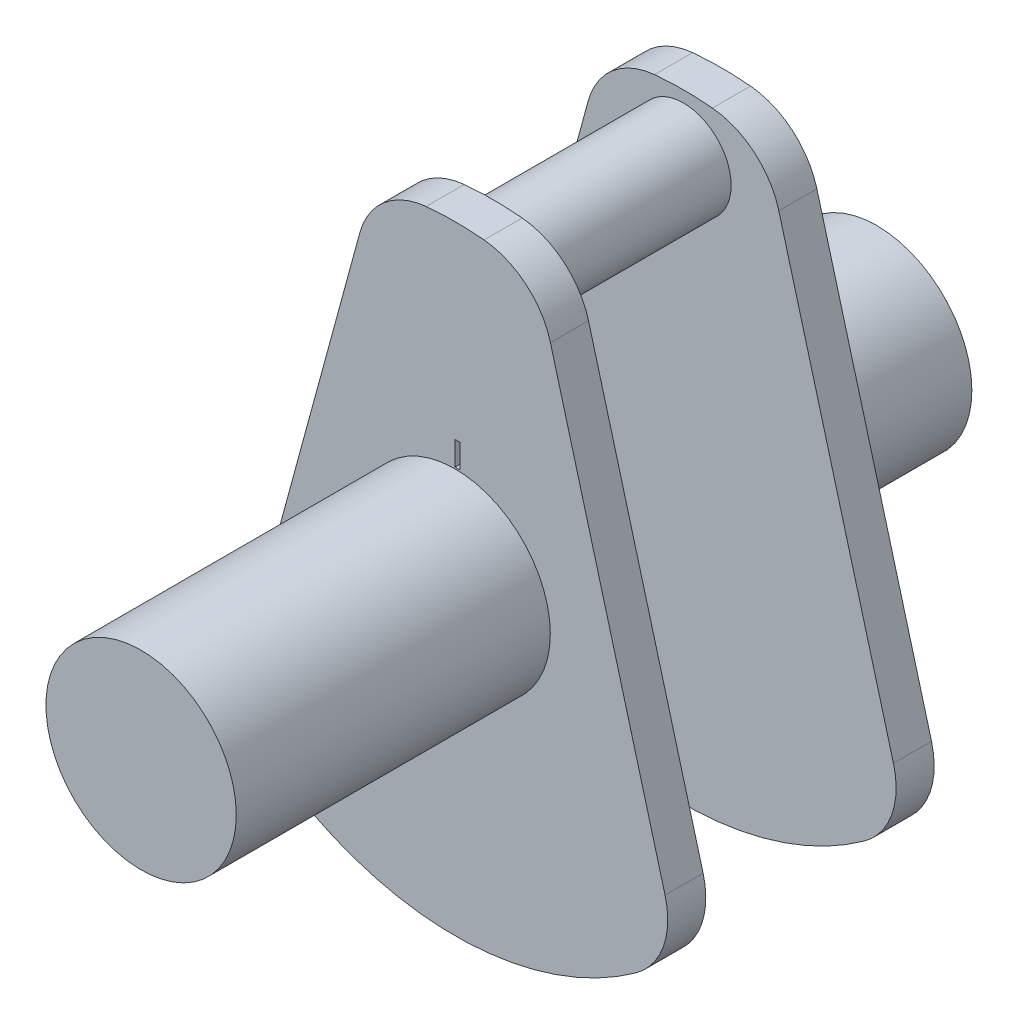
ISO-10303-21;
HEADER;
FILE_DESCRIPTION(('STEP AP214'),'2;1');
FILE_NAME('part.step','',(''),(''),'','','');
FILE_SCHEMA(('AUTOMOTIVE_DESIGN { 1 0 10303 214 1 1 1 1 }'));
ENDSEC;
DATA;
#1=APPLICATION_CONTEXT('core data for automotive mechanical design processes');
#2=APPLICATION_PROTOCOL_DEFINITION('international standard','automotive_design',2000,#1);
#3=PRODUCT_CONTEXT('',#1,'mechanical');
#4=PRODUCT('Part','Part','',(#3));
#5=PRODUCT_RELATED_PRODUCT_CATEGORY('part','',(#4));
#6=PRODUCT_DEFINITION_FORMATION('','',#4);
#7=PRODUCT_DEFINITION_CONTEXT('part definition',#1,'design');
#8=PRODUCT_DEFINITION('design','',#6,#7);
#9=PRODUCT_DEFINITION_SHAPE('','',#8);
#10=(LENGTH_UNIT() NAMED_UNIT(*) SI_UNIT(.MILLI.,.METRE.));
#11=(NAMED_UNIT(*) PLANE_ANGLE_UNIT() SI_UNIT($,.RADIAN.));
#12=(NAMED_UNIT(*) SI_UNIT($,.STERADIAN.) SOLID_ANGLE_UNIT());
#13=UNCERTAINTY_MEASURE_WITH_UNIT(LENGTH_MEASURE(1.E-05),#10,'distance_accuracy_value','');
#14=(GEOMETRIC_REPRESENTATION_CONTEXT(3) GLOBAL_UNCERTAINTY_ASSIGNED_CONTEXT((#13)) GLOBAL_UNIT_ASSIGNED_CONTEXT((#10,
#11,#12)) REPRESENTATION_CONTEXT('',''));
#15=CARTESIAN_POINT('',(0.,0.,0.));
#16=DIRECTION('',(0.,0.,1.));
#17=DIRECTION('',(1.,0.,0.));
#18=AXIS2_PLACEMENT_3D('',#15,#16,#17);
#19=CARTESIAN_POINT('',(0.459,4.87845457086565,0.8));
#20=DIRECTION('',(0.,0.,-1.));
#21=DIRECTION('',(-1.,0.,0.));
#22=AXIS2_PLACEMENT_3D('',#19,#20,#21);
#23=CYLINDRICAL_SURFACE('',#22,1.6);
#24=CARTESIAN_POINT('',(0.459,4.87845457086565,0.));
#25=DIRECTION('',(0.,0.,1.));
#26=DIRECTION('',(1.,0.,0.));
#27=AXIS2_PLACEMENT_3D('',#24,#25,#26);
#28=CIRCLE('',#27,1.6);
#29=CARTESIAN_POINT('',(2.00284320160388,5.29863092534255,0.));
#30=VERTEX_POINT('',#29);
#31=CARTESIAN_POINT('',(0.608877551020407,6.47141932869934,0.));
#32=VERTEX_POINT('',#31);
#33=EDGE_CURVE('E153',#30,#32,#28,.T.);
#34=ORIENTED_EDGE('',*,*,#33,.T.);
#35=DIRECTION('',(0.,0.,-1.));
#36=VECTOR('',#35,1.);
#37=CARTESIAN_POINT('',(0.608877551020407,6.47141932869934,0.8));
#38=LINE('',#37,#36);
#39=CARTESIAN_POINT('',(0.608877551020407,6.47141932869934,0.8));
#40=VERTEX_POINT('',#39);
#41=EDGE_CURVE('E47',#40,#32,#38,.T.);
#42=ORIENTED_EDGE('',*,*,#41,.F.);
#43=CARTESIAN_POINT('',(0.459,4.87845457086565,0.8));
#44=DIRECTION('',(0.,0.,1.));
#45=DIRECTION('',(1.,0.,0.));
#46=AXIS2_PLACEMENT_3D('',#43,#44,#45);
#47=CIRCLE('',#46,1.6);
#48=CARTESIAN_POINT('',(2.00284320160388,5.29863092534255,0.8));
#49=VERTEX_POINT('',#48);
#50=EDGE_CURVE('E177',#49,#40,#47,.T.);
#51=ORIENTED_EDGE('',*,*,#50,.F.);
#52=DIRECTION('',(0.,0.,-1.));
#53=VECTOR('',#52,1.);
#54=CARTESIAN_POINT('',(2.00284320160388,5.29863092534255,0.8));
#55=LINE('',#54,#53);
#56=EDGE_CURVE('E149',#49,#30,#55,.T.);
#57=ORIENTED_EDGE('',*,*,#56,.T.);
#58=EDGE_LOOP('',(#34,#42,#51,#57));
#59=FACE_BOUND('',#58,.T.);
#60=ADVANCED_FACE('F39',(#59),#23,.T.);
#61=CARTESIAN_POINT('',(0.,0.,0.8));
#62=DIRECTION('',(0.,0.,-1.));
#63=DIRECTION('',(-1.,0.,0.));
#64=AXIS2_PLACEMENT_3D('',#61,#62,#63);
#65=CYLINDRICAL_SURFACE('',#64,6.5);
#66=CARTESIAN_POINT('',(0.,0.,0.));
#67=DIRECTION('',(0.,0.,1.));
#68=DIRECTION('',(1.,0.,0.));
#69=AXIS2_PLACEMENT_3D('',#66,#67,#68);
#70=CIRCLE('',#69,6.5);
#71=CARTESIAN_POINT('',(-0.608877551020407,6.47141932869934,0.));
#72=VERTEX_POINT('',#71);
#73=EDGE_CURVE('E157',#32,#72,#70,.T.);
#74=ORIENTED_EDGE('',*,*,#73,.T.);
#75=DIRECTION('',(0.,0.,-1.));
#76=VECTOR('',#75,1.);
#77=CARTESIAN_POINT('',(-0.608877551020407,6.47141932869934,0.8));
#78=LINE('',#77,#76);
#79=CARTESIAN_POINT('',(-0.608877551020407,6.47141932869934,0.8));
#80=VERTEX_POINT('',#79);
#81=EDGE_CURVE('E192',#80,#72,#78,.T.);
#82=ORIENTED_EDGE('',*,*,#81,.F.);
#83=CARTESIAN_POINT('',(0.,0.,0.8));
#84=DIRECTION('',(0.,0.,1.));
#85=DIRECTION('',(1.,0.,0.));
#86=AXIS2_PLACEMENT_3D('',#83,#84,#85);
#87=CIRCLE('',#86,6.5);
#88=EDGE_CURVE('E105',#40,#80,#87,.T.);
#89=ORIENTED_EDGE('',*,*,#88,.F.);
#90=ORIENTED_EDGE('',*,*,#41,.T.);
#91=EDGE_LOOP('',(#74,#82,#89,#90));
#92=FACE_BOUND('',#91,.T.);
#93=ADVANCED_FACE('F197',(#92),#65,.T.);
#94=CARTESIAN_POINT('',(-0.459,4.87845457086565,0.8));
#95=DIRECTION('',(0.,0.,-1.));
#96=DIRECTION('',(-1.,0.,0.));
#97=AXIS2_PLACEMENT_3D('',#94,#95,#96);
#98=CYLINDRICAL_SURFACE('',#97,1.6);
#99=CARTESIAN_POINT('',(-0.459,4.87845457086565,0.));
#100=DIRECTION('',(0.,0.,1.));
#101=DIRECTION('',(-1.,0.,0.));
#102=AXIS2_PLACEMENT_3D('',#99,#100,#101);
#103=CIRCLE('',#102,1.6);
#104=CARTESIAN_POINT('',(-2.00284320160388,5.29863092534255,0.));
#105=VERTEX_POINT('',#104);
#106=EDGE_CURVE('E161',#72,#105,#103,.T.);
#107=ORIENTED_EDGE('',*,*,#106,.T.);
#108=DIRECTION('',(0.,0.,-1.));
#109=VECTOR('',#108,1.);
#110=CARTESIAN_POINT('',(-2.00284320160388,5.29863092534255,0.8));
#111=LINE('',#110,#109);
#112=CARTESIAN_POINT('',(-2.00284320160388,5.29863092534255,0.8));
#113=VERTEX_POINT('',#112);
#114=EDGE_CURVE('E188',#113,#105,#111,.T.);
#115=ORIENTED_EDGE('',*,*,#114,.F.);
#116=CARTESIAN_POINT('',(-0.459,4.87845457086565,0.8));
#117=DIRECTION('',(0.,0.,1.));
#118=DIRECTION('',(-1.,0.,0.));
#119=AXIS2_PLACEMENT_3D('',#116,#117,#118);
#120=CIRCLE('',#119,1.6);
#121=EDGE_CURVE('E216',#80,#113,#120,.T.);
#122=ORIENTED_EDGE('',*,*,#121,.F.);
#123=ORIENTED_EDGE('',*,*,#81,.T.);
#124=EDGE_LOOP('',(#107,#115,#122,#123));
#125=FACE_BOUND('',#124,.T.);
#126=ADVANCED_FACE('F208',(#125),#98,.T.);
#127=CARTESIAN_POINT('',(-2.00284320160388,5.29863092534255,0.8));
#128=DIRECTION('',(0.964902001002423,-0.26261022154806,0.));
#129=DIRECTION('',(0.26261022154806,0.964902001002423,0.));
#130=AXIS2_PLACEMENT_3D('',#127,#128,#129);
#131=PLANE('',#130);
#132=DIRECTION('',(-0.26261022154806,-0.964902001002423,0.));
#133=VECTOR('',#132,1.);
#134=CARTESIAN_POINT('',(-2.00284320160388,5.29863092534255,0.));
#135=LINE('',#134,#133);
#136=CARTESIAN_POINT('',(-4.41186786120333,-3.55278658921254,0.));
#137=VERTEX_POINT('',#136);
#138=EDGE_CURVE('E164',#105,#137,#135,.T.);
#139=ORIENTED_EDGE('',*,*,#138,.T.);
#140=DIRECTION('',(0.,0.,-1.));
#141=VECTOR('',#140,1.);
#142=CARTESIAN_POINT('',(-4.41186786120333,-3.55278658921254,0.8));
#143=LINE('',#142,#141);
#144=CARTESIAN_POINT('',(-4.41186786120333,-3.55278658921254,0.8));
#145=VERTEX_POINT('',#144);
#146=EDGE_CURVE('E184',#145,#137,#143,.T.);
#147=ORIENTED_EDGE('',*,*,#146,.F.);
#148=DIRECTION('',(-0.26261022154806,-0.964902001002423,0.));
#149=VECTOR('',#148,1.);
#150=CARTESIAN_POINT('',(-2.00284320160388,5.29863092534255,0.8));
#151=LINE('',#150,#149);
#152=EDGE_CURVE('E214',#113,#145,#151,.T.);
#153=ORIENTED_EDGE('',*,*,#152,.F.);
#154=ORIENTED_EDGE('',*,*,#114,.T.);
#155=EDGE_LOOP('',(#139,#147,#153,#154));
#156=FACE_BOUND('',#155,.T.);
#157=ADVANCED_FACE('F212',(#156),#131,.F.);
#158=CARTESIAN_POINT('',(-2.86802465959945,-3.97296294368944,0.8));
#159=DIRECTION('',(0.,0.,-1.));
#160=DIRECTION('',(-1.,0.,0.));
#161=AXIS2_PLACEMENT_3D('',#158,#159,#160);
#162=CYLINDRICAL_SURFACE('',#161,1.6);
#163=CARTESIAN_POINT('',(-2.86802465959945,-3.97296294368944,0.));
#164=DIRECTION('',(0.,0.,1.));
#165=DIRECTION('',(1.,0.,0.));
#166=AXIS2_PLACEMENT_3D('',#163,#164,#165);
#167=CIRCLE('',#166,1.6);
#168=CARTESIAN_POINT('',(-3.80452250763192,-5.27025696611864,0.));
#169=VERTEX_POINT('',#168);
#170=EDGE_CURVE('E167',#137,#169,#167,.T.);
#171=ORIENTED_EDGE('',*,*,#170,.T.);
#172=DIRECTION('',(0.,0.,-1.));
#173=VECTOR('',#172,1.);
#174=CARTESIAN_POINT('',(-3.80452250763192,-5.27025696611864,0.8));
#175=LINE('',#174,#173);
#176=CARTESIAN_POINT('',(-3.80452250763192,-5.27025696611864,0.8));
#177=VERTEX_POINT('',#176);
#178=EDGE_CURVE('E142',#177,#169,#175,.T.);
#179=ORIENTED_EDGE('',*,*,#178,.F.);
#180=CARTESIAN_POINT('',(-2.86802465959945,-3.97296294368944,0.8));
#181=DIRECTION('',(0.,0.,1.));
#182=DIRECTION('',(1.,0.,0.));
#183=AXIS2_PLACEMENT_3D('',#180,#181,#182);
#184=CIRCLE('',#183,1.6);
#185=EDGE_CURVE('E128',#145,#177,#184,.T.);
#186=ORIENTED_EDGE('',*,*,#185,.F.);
#187=ORIENTED_EDGE('',*,*,#146,.T.);
#188=EDGE_LOOP('',(#171,#179,#186,#187));
#189=FACE_BOUND('',#188,.T.);
#190=ADVANCED_FACE('F503',(#189),#162,.T.);
#191=CARTESIAN_POINT('',(0.,0.,0.8));
#192=DIRECTION('',(0.,0.,-1.));
#193=DIRECTION('',(-1.,0.,0.));
#194=AXIS2_PLACEMENT_3D('',#191,#192,#193);
#195=CYLINDRICAL_SURFACE('',#194,6.5);
#196=CARTESIAN_POINT('',(0.,0.,0.));
#197=DIRECTION('',(0.,0.,1.));
#198=DIRECTION('',(1.,0.,0.));
#199=AXIS2_PLACEMENT_3D('',#196,#197,#198);
#200=CIRCLE('',#199,6.5);
#201=CARTESIAN_POINT('',(3.80452250763193,-5.27025696611864,0.));
#202=VERTEX_POINT('',#201);
#203=EDGE_CURVE('E138',#169,#202,#200,.T.);
#204=ORIENTED_EDGE('',*,*,#203,.T.);
#205=DIRECTION('',(0.,0.,-1.));
#206=VECTOR('',#205,1.);
#207=CARTESIAN_POINT('',(3.80452250763193,-5.27025696611864,0.8));
#208=LINE('',#207,#206);
#209=CARTESIAN_POINT('',(3.80452250763193,-5.27025696611864,0.8));
#210=VERTEX_POINT('',#209);
#211=EDGE_CURVE('E135',#210,#202,#208,.T.);
#212=ORIENTED_EDGE('',*,*,#211,.F.);
#213=CARTESIAN_POINT('',(0.,0.,0.8));
#214=DIRECTION('',(0.,0.,1.));
#215=DIRECTION('',(1.,0.,0.));
#216=AXIS2_PLACEMENT_3D('',#213,#214,#215);
#217=CIRCLE('',#216,6.5);
#218=EDGE_CURVE('E121',#177,#210,#217,.T.);
#219=ORIENTED_EDGE('',*,*,#218,.F.);
#220=ORIENTED_EDGE('',*,*,#178,.T.);
#221=EDGE_LOOP('',(#204,#212,#219,#220));
#222=FACE_BOUND('',#221,.T.);
#223=ADVANCED_FACE('F136',(#222),#195,.T.);
#224=CARTESIAN_POINT('',(2.86802465959945,-3.97296294368944,0.8));
#225=DIRECTION('',(0.,0.,-1.));
#226=DIRECTION('',(-1.,0.,0.));
#227=AXIS2_PLACEMENT_3D('',#224,#225,#226);
#228=CYLINDRICAL_SURFACE('',#227,1.6);
#229=CARTESIAN_POINT('',(2.86802465959945,-3.97296294368944,0.));
#230=DIRECTION('',(0.,0.,1.));
#231=DIRECTION('',(-1.,0.,0.));
#232=AXIS2_PLACEMENT_3D('',#229,#230,#231);
#233=CIRCLE('',#232,1.6);
#234=CARTESIAN_POINT('',(4.41186786120333,-3.55278658921254,0.));
#235=VERTEX_POINT('',#234);
#236=EDGE_CURVE('E172',#202,#235,#233,.T.);
#237=ORIENTED_EDGE('',*,*,#236,.T.);
#238=DIRECTION('',(0.,0.,-1.));
#239=VECTOR('',#238,1.);
#240=CARTESIAN_POINT('',(4.41186786120333,-3.55278658921254,0.8));
#241=LINE('',#240,#239);
#242=CARTESIAN_POINT('',(4.41186786120333,-3.55278658921254,0.8));
#243=VERTEX_POINT('',#242);
#244=EDGE_CURVE('E143',#243,#235,#241,.T.);
#245=ORIENTED_EDGE('',*,*,#244,.F.);
#246=CARTESIAN_POINT('',(2.86802465959945,-3.97296294368944,0.8));
#247=DIRECTION('',(0.,0.,1.));
#248=DIRECTION('',(-1.,0.,0.));
#249=AXIS2_PLACEMENT_3D('',#246,#247,#248);
#250=CIRCLE('',#249,1.6);
#251=EDGE_CURVE('E125',#210,#243,#250,.T.);
#252=ORIENTED_EDGE('',*,*,#251,.F.);
#253=ORIENTED_EDGE('',*,*,#211,.T.);
#254=EDGE_LOOP('',(#237,#245,#252,#253));
#255=FACE_BOUND('',#254,.T.);
#256=ADVANCED_FACE('F145',(#255),#228,.T.);
#257=CARTESIAN_POINT('',(2.00284320160388,5.29863092534255,0.8));
#258=DIRECTION('',(-0.964902001002423,-0.26261022154806,0.));
#259=DIRECTION('',(0.26261022154806,-0.964902001002423,0.));
#260=AXIS2_PLACEMENT_3D('',#257,#258,#259);
#261=PLANE('',#260);
#262=DIRECTION('',(-0.26261022154806,0.964902001002423,0.));
#263=VECTOR('',#262,1.);
#264=CARTESIAN_POINT('',(2.00284320160388,5.29863092534255,0.));
#265=LINE('',#264,#263);
#266=EDGE_CURVE('E96',#235,#30,#265,.T.);
#267=ORIENTED_EDGE('',*,*,#266,.T.);
#268=ORIENTED_EDGE('',*,*,#56,.F.);
#269=DIRECTION('',(-0.26261022154806,0.964902001002423,0.));
#270=VECTOR('',#269,1.);
#271=CARTESIAN_POINT('',(2.00284320160388,5.29863092534255,0.8));
#272=LINE('',#271,#270);
#273=EDGE_CURVE('E63',#243,#49,#272,.T.);
#274=ORIENTED_EDGE('',*,*,#273,.F.);
#275=ORIENTED_EDGE('',*,*,#244,.T.);
#276=EDGE_LOOP('',(#267,#268,#274,#275));
#277=FACE_BOUND('',#276,.T.);
#278=ADVANCED_FACE('F511',(#277),#261,.F.);
#279=CARTESIAN_POINT('',(0.459,4.87845457086565,0.8));
#280=DIRECTION('',(0.,0.,1.));
#281=DIRECTION('',(1.,0.,0.));
#282=AXIS2_PLACEMENT_3D('',#279,#280,#281);
#283=PLANE('',#282);
#284=CARTESIAN_POINT('',(0.,5.259,0.8));
#285=DIRECTION('',(0.,0.,1.));
#286=DIRECTION('',(1.,0.,0.));
#287=AXIS2_PLACEMENT_3D('',#284,#285,#286);
#288=CIRCLE('',#287,1.);
#289=CARTESIAN_POINT('',(1.,5.259,0.8));
#290=VERTEX_POINT('',#289);
#291=EDGE_CURVE('E158',#290,#290,#288,.T.);
#292=ORIENTED_EDGE('',*,*,#291,.F.);
#293=EDGE_LOOP('',(#292));
#294=FACE_BOUND('',#293,.T.);
#295=ORIENTED_EDGE('',*,*,#50,.T.);
#296=ORIENTED_EDGE('',*,*,#88,.T.);
#297=ORIENTED_EDGE('',*,*,#121,.T.);
#298=ORIENTED_EDGE('',*,*,#152,.T.);
#299=ORIENTED_EDGE('',*,*,#185,.T.);
#300=ORIENTED_EDGE('',*,*,#218,.T.);
#301=ORIENTED_EDGE('',*,*,#251,.T.);
#302=ORIENTED_EDGE('',*,*,#273,.T.);
#303=EDGE_LOOP('',(#295,#296,#297,#298,#299,#300,#301,#302));
#304=FACE_BOUND('',#303,.T.);
#305=ADVANCED_FACE('F123',(#294,#304),#283,.T.);
#306=CARTESIAN_POINT('',(0.459,4.87845457086565,0.));
#307=DIRECTION('',(0.,0.,1.));
#308=DIRECTION('',(1.,0.,0.));
#309=AXIS2_PLACEMENT_3D('',#306,#307,#308);
#310=PLANE('',#309);
#311=CARTESIAN_POINT('',(0.,0.,0.));
#312=DIRECTION('',(0.,0.,1.));
#313=DIRECTION('',(1.,0.,0.));
#314=AXIS2_PLACEMENT_3D('',#311,#312,#313);
#315=CIRCLE('',#314,2.);
#316=CARTESIAN_POINT('',(2.,0.,0.));
#317=VERTEX_POINT('',#316);
#318=EDGE_CURVE('E11',#317,#317,#315,.F.);
#319=ORIENTED_EDGE('',*,*,#318,.F.);
#320=EDGE_LOOP('',(#319));
#321=FACE_BOUND('',#320,.T.);
#322=ORIENTED_EDGE('',*,*,#33,.F.);
#323=ORIENTED_EDGE('',*,*,#266,.F.);
#324=ORIENTED_EDGE('',*,*,#236,.F.);
#325=ORIENTED_EDGE('',*,*,#203,.F.);
#326=ORIENTED_EDGE('',*,*,#170,.F.);
#327=ORIENTED_EDGE('',*,*,#138,.F.);
#328=ORIENTED_EDGE('',*,*,#106,.F.);
#329=ORIENTED_EDGE('',*,*,#73,.F.);
#330=EDGE_LOOP('',(#322,#323,#324,#325,#326,#327,#328,#329));
#331=FACE_BOUND('',#330,.T.);
#332=ADVANCED_FACE('F202',(#321,#331),#310,.F.);
#333=CARTESIAN_POINT('',(0.,5.259,2.8));
#334=DIRECTION('',(0.,0.,-1.));
#335=DIRECTION('',(-1.,0.,0.));
#336=AXIS2_PLACEMENT_3D('',#333,#334,#335);
#337=CYLINDRICAL_SURFACE('',#336,1.);
#338=ORIENTED_EDGE('',*,*,#291,.T.);
#339=EDGE_LOOP('',(#338));
#340=FACE_BOUND('',#339,.T.);
#341=CARTESIAN_POINT('',(0.,5.259,4.8));
#342=DIRECTION('',(0.,0.,1.));
#343=DIRECTION('',(1.,0.,0.));
#344=AXIS2_PLACEMENT_3D('',#341,#342,#343);
#345=CIRCLE('',#344,1.);
#346=CARTESIAN_POINT('',(1.,5.259,4.8));
#347=VERTEX_POINT('',#346);
#348=EDGE_CURVE('E303',#347,#347,#345,.T.);
#349=ORIENTED_EDGE('',*,*,#348,.F.);
#350=EDGE_LOOP('',(#349));
#351=FACE_BOUND('',#350,.T.);
#352=ADVANCED_FACE('F516',(#340,#351),#337,.T.);
#353=CARTESIAN_POINT('',(0.,0.,-3.26));
#354=DIRECTION('',(0.,0.,1.));
#355=DIRECTION('',(1.,0.,0.));
#356=AXIS2_PLACEMENT_3D('',#353,#354,#355);
#357=CYLINDRICAL_SURFACE('',#356,2.);
#358=CARTESIAN_POINT('',(0.,0.,-3.26));
#359=DIRECTION('',(0.,0.,-1.));
#360=DIRECTION('',(-1.,0.,0.));
#361=AXIS2_PLACEMENT_3D('',#358,#359,#360);
#362=CIRCLE('',#361,2.);
#363=CARTESIAN_POINT('',(-2.,0.,-3.26));
#364=VERTEX_POINT('',#363);
#365=EDGE_CURVE('E229',#364,#364,#362,.T.);
#366=ORIENTED_EDGE('',*,*,#365,.F.);
#367=EDGE_LOOP('',(#366));
#368=FACE_BOUND('',#367,.T.);
#369=ORIENTED_EDGE('',*,*,#318,.T.);
#370=EDGE_LOOP('',(#369));
#371=FACE_BOUND('',#370,.T.);
#372=ADVANCED_FACE('F523',(#368,#371),#357,.T.);
#373=CARTESIAN_POINT('',(0.,0.,-3.26));
#374=DIRECTION('',(0.,0.,-1.));
#375=DIRECTION('',(-1.,0.,0.));
#376=AXIS2_PLACEMENT_3D('',#373,#374,#375);
#377=PLANE('',#376);
#378=ORIENTED_EDGE('',*,*,#365,.T.);
#379=EDGE_LOOP('',(#378));
#380=FACE_BOUND('',#379,.T.);
#381=ADVANCED_FACE('F527',(#380),#377,.T.);
#382=CARTESIAN_POINT('',(0.459,4.87845457086565,4.8));
#383=DIRECTION('',(0.,0.,1.));
#384=DIRECTION('',(-1.,0.,0.));
#385=AXIS2_PLACEMENT_3D('',#382,#383,#384);
#386=CYLINDRICAL_SURFACE('',#385,1.6);
#387=CARTESIAN_POINT('',(0.459,4.87845457086565,5.6));
#388=DIRECTION('',(0.,0.,1.));
#389=DIRECTION('',(1.,0.,0.));
#390=AXIS2_PLACEMENT_3D('',#387,#388,#389);
#391=CIRCLE('',#390,1.6);
#392=CARTESIAN_POINT('',(2.00284320160388,5.29863092534255,5.6));
#393=VERTEX_POINT('',#392);
#394=CARTESIAN_POINT('',(0.608877551020407,6.47141932869934,5.6));
#395=VERTEX_POINT('',#394);
#396=EDGE_CURVE('E299',#393,#395,#391,.T.);
#397=ORIENTED_EDGE('',*,*,#396,.F.);
#398=DIRECTION('',(0.,0.,1.));
#399=VECTOR('',#398,1.);
#400=CARTESIAN_POINT('',(2.00284320160388,5.29863092534255,4.8));
#401=LINE('',#400,#399);
#402=CARTESIAN_POINT('',(2.00284320160388,5.29863092534255,4.8));
#403=VERTEX_POINT('',#402);
#404=EDGE_CURVE('E265',#403,#393,#401,.T.);
#405=ORIENTED_EDGE('',*,*,#404,.F.);
#406=CARTESIAN_POINT('',(0.459,4.87845457086565,4.8));
#407=DIRECTION('',(0.,0.,1.));
#408=DIRECTION('',(1.,0.,0.));
#409=AXIS2_PLACEMENT_3D('',#406,#407,#408);
#410=CIRCLE('',#409,1.6);
#411=CARTESIAN_POINT('',(0.608877551020407,6.47141932869934,4.8));
#412=VERTEX_POINT('',#411);
#413=EDGE_CURVE('E274',#403,#412,#410,.T.);
#414=ORIENTED_EDGE('',*,*,#413,.T.);
#415=DIRECTION('',(0.,0.,1.));
#416=VECTOR('',#415,1.);
#417=CARTESIAN_POINT('',(0.608877551020407,6.47141932869934,4.8));
#418=LINE('',#417,#416);
#419=EDGE_CURVE('E237',#412,#395,#418,.T.);
#420=ORIENTED_EDGE('',*,*,#419,.T.);
#421=EDGE_LOOP('',(#397,#405,#414,#420));
#422=FACE_BOUND('',#421,.T.);
#423=ADVANCED_FACE('F459',(#422),#386,.T.);
#424=CARTESIAN_POINT('',(0.,0.,4.8));
#425=DIRECTION('',(0.,0.,1.));
#426=DIRECTION('',(-1.,0.,0.));
#427=AXIS2_PLACEMENT_3D('',#424,#425,#426);
#428=CYLINDRICAL_SURFACE('',#427,6.5);
#429=CARTESIAN_POINT('',(0.,0.,5.6));
#430=DIRECTION('',(0.,0.,1.));
#431=DIRECTION('',(1.,0.,0.));
#432=AXIS2_PLACEMENT_3D('',#429,#430,#431);
#433=CIRCLE('',#432,6.5);
#434=CARTESIAN_POINT('',(-0.608877551020407,6.47141932869934,5.6));
#435=VERTEX_POINT('',#434);
#436=EDGE_CURVE('E295',#395,#435,#433,.T.);
#437=ORIENTED_EDGE('',*,*,#436,.F.);
#438=ORIENTED_EDGE('',*,*,#419,.F.);
#439=CARTESIAN_POINT('',(0.,0.,4.8));
#440=DIRECTION('',(0.,0.,1.));
#441=DIRECTION('',(1.,0.,0.));
#442=AXIS2_PLACEMENT_3D('',#439,#440,#441);
#443=CIRCLE('',#442,6.5);
#444=CARTESIAN_POINT('',(-0.608877551020407,6.47141932869934,4.8));
#445=VERTEX_POINT('',#444);
#446=EDGE_CURVE('E327',#412,#445,#443,.T.);
#447=ORIENTED_EDGE('',*,*,#446,.T.);
#448=DIRECTION('',(0.,0.,1.));
#449=VECTOR('',#448,1.);
#450=CARTESIAN_POINT('',(-0.608877551020407,6.47141932869934,4.8));
#451=LINE('',#450,#449);
#452=EDGE_CURVE('E241',#445,#435,#451,.T.);
#453=ORIENTED_EDGE('',*,*,#452,.T.);
#454=EDGE_LOOP('',(#437,#438,#447,#453));
#455=FACE_BOUND('',#454,.T.);
#456=ADVANCED_FACE('F462',(#455),#428,.T.);
#457=CARTESIAN_POINT('',(-0.459,4.87845457086565,4.8));
#458=DIRECTION('',(0.,0.,1.));
#459=DIRECTION('',(-1.,0.,0.));
#460=AXIS2_PLACEMENT_3D('',#457,#458,#459);
#461=CYLINDRICAL_SURFACE('',#460,1.6);
#462=CARTESIAN_POINT('',(-0.459,4.87845457086565,5.6));
#463=DIRECTION('',(0.,0.,1.));
#464=DIRECTION('',(-1.,0.,0.));
#465=AXIS2_PLACEMENT_3D('',#462,#463,#464);
#466=CIRCLE('',#465,1.6);
#467=CARTESIAN_POINT('',(-2.00284320160388,5.29863092534255,5.6));
#468=VERTEX_POINT('',#467);
#469=EDGE_CURVE('E291',#435,#468,#466,.T.);
#470=ORIENTED_EDGE('',*,*,#469,.F.);
#471=ORIENTED_EDGE('',*,*,#452,.F.);
#472=CARTESIAN_POINT('',(-0.459,4.87845457086565,4.8));
#473=DIRECTION('',(0.,0.,1.));
#474=DIRECTION('',(-1.,0.,0.));
#475=AXIS2_PLACEMENT_3D('',#472,#473,#474);
#476=CIRCLE('',#475,1.6);
#477=CARTESIAN_POINT('',(-2.00284320160388,5.29863092534255,4.8));
#478=VERTEX_POINT('',#477);
#479=EDGE_CURVE('E323',#445,#478,#476,.T.);
#480=ORIENTED_EDGE('',*,*,#479,.T.);
#481=DIRECTION('',(0.,0.,1.));
#482=VECTOR('',#481,1.);
#483=CARTESIAN_POINT('',(-2.00284320160388,5.29863092534255,4.8));
#484=LINE('',#483,#482);
#485=EDGE_CURVE('E245',#478,#468,#484,.T.);
#486=ORIENTED_EDGE('',*,*,#485,.T.);
#487=EDGE_LOOP('',(#470,#471,#480,#486));
#488=FACE_BOUND('',#487,.T.);
#489=ADVANCED_FACE('F465',(#488),#461,.T.);
#490=CARTESIAN_POINT('',(-2.00284320160388,5.29863092534255,4.8));
#491=DIRECTION('',(0.964902001002423,-0.26261022154806,0.));
#492=DIRECTION('',(0.26261022154806,0.964902001002423,0.));
#493=AXIS2_PLACEMENT_3D('',#490,#491,#492);
#494=PLANE('',#493);
#495=DIRECTION('',(-0.26261022154806,-0.964902001002423,0.));
#496=VECTOR('',#495,1.);
#497=CARTESIAN_POINT('',(-2.00284320160388,5.29863092534255,5.6));
#498=LINE('',#497,#496);
#499=CARTESIAN_POINT('',(-4.41186786120333,-3.55278658921254,5.6));
#500=VERTEX_POINT('',#499);
#501=EDGE_CURVE('E287',#468,#500,#498,.T.);
#502=ORIENTED_EDGE('',*,*,#501,.F.);
#503=ORIENTED_EDGE('',*,*,#485,.F.);
#504=DIRECTION('',(-0.26261022154806,-0.964902001002423,0.));
#505=VECTOR('',#504,1.);
#506=CARTESIAN_POINT('',(-2.00284320160388,5.29863092534255,4.8));
#507=LINE('',#506,#505);
#508=CARTESIAN_POINT('',(-4.41186786120333,-3.55278658921254,4.8));
#509=VERTEX_POINT('',#508);
#510=EDGE_CURVE('E319',#478,#509,#507,.T.);
#511=ORIENTED_EDGE('',*,*,#510,.T.);
#512=DIRECTION('',(0.,0.,1.));
#513=VECTOR('',#512,1.);
#514=CARTESIAN_POINT('',(-4.41186786120333,-3.55278658921254,4.8));
#515=LINE('',#514,#513);
#516=EDGE_CURVE('E249',#509,#500,#515,.T.);
#517=ORIENTED_EDGE('',*,*,#516,.T.);
#518=EDGE_LOOP('',(#502,#503,#511,#517));
#519=FACE_BOUND('',#518,.T.);
#520=ADVANCED_FACE('F468',(#519),#494,.F.);
#521=CARTESIAN_POINT('',(-2.86802465959945,-3.97296294368944,4.8));
#522=DIRECTION('',(0.,0.,1.));
#523=DIRECTION('',(-1.,0.,0.));
#524=AXIS2_PLACEMENT_3D('',#521,#522,#523);
#525=CYLINDRICAL_SURFACE('',#524,1.6);
#526=CARTESIAN_POINT('',(-2.86802465959945,-3.97296294368944,5.6));
#527=DIRECTION('',(0.,0.,1.));
#528=DIRECTION('',(1.,0.,0.));
#529=AXIS2_PLACEMENT_3D('',#526,#527,#528);
#530=CIRCLE('',#529,1.6);
#531=CARTESIAN_POINT('',(-3.80452250763192,-5.27025696611864,5.6));
#532=VERTEX_POINT('',#531);
#533=EDGE_CURVE('E283',#500,#532,#530,.T.);
#534=ORIENTED_EDGE('',*,*,#533,.F.);
#535=ORIENTED_EDGE('',*,*,#516,.F.);
#536=CARTESIAN_POINT('',(-2.86802465959945,-3.97296294368944,4.8));
#537=DIRECTION('',(0.,0.,1.));
#538=DIRECTION('',(1.,0.,0.));
#539=AXIS2_PLACEMENT_3D('',#536,#537,#538);
#540=CIRCLE('',#539,1.6);
#541=CARTESIAN_POINT('',(-3.80452250763192,-5.27025696611864,4.8));
#542=VERTEX_POINT('',#541);
#543=EDGE_CURVE('E315',#509,#542,#540,.T.);
#544=ORIENTED_EDGE('',*,*,#543,.T.);
#545=DIRECTION('',(0.,0.,1.));
#546=VECTOR('',#545,1.);
#547=CARTESIAN_POINT('',(-3.80452250763192,-5.27025696611864,4.8));
#548=LINE('',#547,#546);
#549=EDGE_CURVE('E253',#542,#532,#548,.T.);
#550=ORIENTED_EDGE('',*,*,#549,.T.);
#551=EDGE_LOOP('',(#534,#535,#544,#550));
#552=FACE_BOUND('',#551,.T.);
#553=ADVANCED_FACE('F471',(#552),#525,.T.);
#554=CARTESIAN_POINT('',(0.,0.,4.8));
#555=DIRECTION('',(0.,0.,1.));
#556=DIRECTION('',(-1.,0.,0.));
#557=AXIS2_PLACEMENT_3D('',#554,#555,#556);
#558=CYLINDRICAL_SURFACE('',#557,6.5);
#559=CARTESIAN_POINT('',(0.,0.,5.6));
#560=DIRECTION('',(0.,0.,1.));
#561=DIRECTION('',(1.,0.,0.));
#562=AXIS2_PLACEMENT_3D('',#559,#560,#561);
#563=CIRCLE('',#562,6.5);
#564=CARTESIAN_POINT('',(3.80452250763193,-5.27025696611864,5.6));
#565=VERTEX_POINT('',#564);
#566=EDGE_CURVE('E279',#532,#565,#563,.T.);
#567=ORIENTED_EDGE('',*,*,#566,.F.);
#568=ORIENTED_EDGE('',*,*,#549,.F.);
#569=CARTESIAN_POINT('',(0.,0.,4.8));
#570=DIRECTION('',(0.,0.,1.));
#571=DIRECTION('',(1.,0.,0.));
#572=AXIS2_PLACEMENT_3D('',#569,#570,#571);
#573=CIRCLE('',#572,6.5);
#574=CARTESIAN_POINT('',(3.80452250763193,-5.27025696611864,4.8));
#575=VERTEX_POINT('',#574);
#576=EDGE_CURVE('E311',#542,#575,#573,.T.);
#577=ORIENTED_EDGE('',*,*,#576,.T.);
#578=DIRECTION('',(0.,0.,1.));
#579=VECTOR('',#578,1.);
#580=CARTESIAN_POINT('',(3.80452250763193,-5.27025696611864,4.8));
#581=LINE('',#580,#579);
#582=EDGE_CURVE('E257',#575,#565,#581,.T.);
#583=ORIENTED_EDGE('',*,*,#582,.T.);
#584=EDGE_LOOP('',(#567,#568,#577,#583));
#585=FACE_BOUND('',#584,.T.);
#586=ADVANCED_FACE('F474',(#585),#558,.T.);
#587=CARTESIAN_POINT('',(2.86802465959945,-3.97296294368944,4.8));
#588=DIRECTION('',(0.,0.,1.));
#589=DIRECTION('',(-1.,0.,0.));
#590=AXIS2_PLACEMENT_3D('',#587,#588,#589);
#591=CYLINDRICAL_SURFACE('',#590,1.6);
#592=CARTESIAN_POINT('',(2.86802465959945,-3.97296294368944,5.6));
#593=DIRECTION('',(0.,0.,1.));
#594=DIRECTION('',(-1.,0.,0.));
#595=AXIS2_PLACEMENT_3D('',#592,#593,#594);
#596=CIRCLE('',#595,1.6);
#597=CARTESIAN_POINT('',(4.41186786120333,-3.55278658921254,5.6));
#598=VERTEX_POINT('',#597);
#599=EDGE_CURVE('E275',#565,#598,#596,.T.);
#600=ORIENTED_EDGE('',*,*,#599,.F.);
#601=ORIENTED_EDGE('',*,*,#582,.F.);
#602=CARTESIAN_POINT('',(2.86802465959945,-3.97296294368944,4.8));
#603=DIRECTION('',(0.,0.,1.));
#604=DIRECTION('',(-1.,0.,0.));
#605=AXIS2_PLACEMENT_3D('',#602,#603,#604);
#606=CIRCLE('',#605,1.6);
#607=CARTESIAN_POINT('',(4.41186786120333,-3.55278658921254,4.8));
#608=VERTEX_POINT('',#607);
#609=EDGE_CURVE('E307',#575,#608,#606,.T.);
#610=ORIENTED_EDGE('',*,*,#609,.T.);
#611=DIRECTION('',(0.,0.,1.));
#612=VECTOR('',#611,1.);
#613=CARTESIAN_POINT('',(4.41186786120333,-3.55278658921254,4.8));
#614=LINE('',#613,#612);
#615=EDGE_CURVE('E261',#608,#598,#614,.T.);
#616=ORIENTED_EDGE('',*,*,#615,.T.);
#617=EDGE_LOOP('',(#600,#601,#610,#616));
#618=FACE_BOUND('',#617,.T.);
#619=ADVANCED_FACE('F477',(#618),#591,.T.);
#620=CARTESIAN_POINT('',(2.00284320160388,5.29863092534255,4.8));
#621=DIRECTION('',(-0.964902001002423,-0.26261022154806,0.));
#622=DIRECTION('',(0.26261022154806,-0.964902001002423,0.));
#623=AXIS2_PLACEMENT_3D('',#620,#621,#622);
#624=PLANE('',#623);
#625=DIRECTION('',(-0.26261022154806,0.964902001002423,0.));
#626=VECTOR('',#625,1.);
#627=CARTESIAN_POINT('',(2.00284320160388,5.29863092534255,5.6));
#628=LINE('',#627,#626);
#629=EDGE_CURVE('E270',#598,#393,#628,.T.);
#630=ORIENTED_EDGE('',*,*,#629,.F.);
#631=ORIENTED_EDGE('',*,*,#615,.F.);
#632=DIRECTION('',(-0.26261022154806,0.964902001002423,0.));
#633=VECTOR('',#632,1.);
#634=CARTESIAN_POINT('',(2.00284320160388,5.29863092534255,4.8));
#635=LINE('',#634,#633);
#636=EDGE_CURVE('E269',#608,#403,#635,.T.);
#637=ORIENTED_EDGE('',*,*,#636,.T.);
#638=ORIENTED_EDGE('',*,*,#404,.T.);
#639=EDGE_LOOP('',(#630,#631,#637,#638));
#640=FACE_BOUND('',#639,.T.);
#641=ADVANCED_FACE('F456',(#640),#624,.F.);
#642=CARTESIAN_POINT('',(0.459,4.87845457086565,4.8));
#643=DIRECTION('',(0.,0.,-1.));
#644=DIRECTION('',(1.,0.,0.));
#645=AXIS2_PLACEMENT_3D('',#642,#643,#644);
#646=PLANE('',#645);
#647=ORIENTED_EDGE('',*,*,#348,.T.);
#648=EDGE_LOOP('',(#647));
#649=FACE_BOUND('',#648,.T.);
#650=ORIENTED_EDGE('',*,*,#413,.F.);
#651=ORIENTED_EDGE('',*,*,#636,.F.);
#652=ORIENTED_EDGE('',*,*,#609,.F.);
#653=ORIENTED_EDGE('',*,*,#576,.F.);
#654=ORIENTED_EDGE('',*,*,#543,.F.);
#655=ORIENTED_EDGE('',*,*,#510,.F.);
#656=ORIENTED_EDGE('',*,*,#479,.F.);
#657=ORIENTED_EDGE('',*,*,#446,.F.);
#658=EDGE_LOOP('',(#650,#651,#652,#653,#654,#655,#656,#657));
#659=FACE_BOUND('',#658,.T.);
#660=ADVANCED_FACE('F479',(#649,#659),#646,.T.);
#661=CARTESIAN_POINT('',(0.459,4.87845457086565,5.6));
#662=DIRECTION('',(0.,0.,-1.));
#663=DIRECTION('',(1.,0.,0.));
#664=AXIS2_PLACEMENT_3D('',#661,#662,#663);
#665=PLANE('',#664);
#666=DIRECTION('',(0.,-1.,0.));
#667=VECTOR('',#666,1.);
#668=CARTESIAN_POINT('',(0.1,2.53325665087131,5.6));
#669=LINE('',#668,#667);
#670=CARTESIAN_POINT('',(0.1,2.53325665087131,5.6));
#671=VERTEX_POINT('',#670);
#672=CARTESIAN_POINT('',(0.1,2.03325665087131,5.6));
#673=VERTEX_POINT('',#672);
#674=EDGE_CURVE('E365',#671,#673,#669,.T.);
#675=ORIENTED_EDGE('',*,*,#674,.T.);
#676=DIRECTION('',(1.,0.,0.));
#677=VECTOR('',#676,1.);
#678=CARTESIAN_POINT('',(0.,2.03325665087131,5.6));
#679=LINE('',#678,#677);
#680=CARTESIAN_POINT('',(0.,2.03325665087131,5.6));
#681=VERTEX_POINT('',#680);
#682=EDGE_CURVE('E54',#681,#673,#679,.T.);
#683=ORIENTED_EDGE('',*,*,#682,.F.);
#684=DIRECTION('',(0.,-1.,0.));
#685=VECTOR('',#684,1.);
#686=CARTESIAN_POINT('',(0.,2.53325665087131,5.6));
#687=LINE('',#686,#685);
#688=CARTESIAN_POINT('',(0.,2.53325665087131,5.6));
#689=VERTEX_POINT('',#688);
#690=EDGE_CURVE('E356',#689,#681,#687,.T.);
#691=ORIENTED_EDGE('',*,*,#690,.F.);
#692=DIRECTION('',(1.,0.,0.));
#693=VECTOR('',#692,1.);
#694=CARTESIAN_POINT('',(0.,2.53325665087131,5.6));
#695=LINE('',#694,#693);
#696=EDGE_CURVE('E361',#689,#671,#695,.T.);
#697=ORIENTED_EDGE('',*,*,#696,.T.);
#698=EDGE_LOOP('',(#675,#683,#691,#697));
#699=FACE_BOUND('',#698,.T.);
#700=CARTESIAN_POINT('',(0.,0.,5.6));
#701=DIRECTION('',(0.,0.,1.));
#702=DIRECTION('',(1.,0.,0.));
#703=AXIS2_PLACEMENT_3D('',#700,#701,#702);
#704=CIRCLE('',#703,2.);
#705=CARTESIAN_POINT('',(2.,0.,5.6));
#706=VERTEX_POINT('',#705);
#707=EDGE_CURVE('E233',#706,#706,#704,.F.);
#708=ORIENTED_EDGE('',*,*,#707,.T.);
#709=EDGE_LOOP('',(#708));
#710=FACE_BOUND('',#709,.T.);
#711=ORIENTED_EDGE('',*,*,#396,.T.);
#712=ORIENTED_EDGE('',*,*,#436,.T.);
#713=ORIENTED_EDGE('',*,*,#469,.T.);
#714=ORIENTED_EDGE('',*,*,#501,.T.);
#715=ORIENTED_EDGE('',*,*,#533,.T.);
#716=ORIENTED_EDGE('',*,*,#566,.T.);
#717=ORIENTED_EDGE('',*,*,#599,.T.);
#718=ORIENTED_EDGE('',*,*,#629,.T.);
#719=EDGE_LOOP('',(#711,#712,#713,#714,#715,#716,#717,#718));
#720=FACE_BOUND('',#719,.T.);
#721=ADVANCED_FACE('F453',(#699,#710,#720),#665,.F.);
#722=CARTESIAN_POINT('',(0.,0.,8.86));
#723=DIRECTION('',(0.,0.,-1.));
#724=DIRECTION('',(1.,0.,0.));
#725=AXIS2_PLACEMENT_3D('',#722,#723,#724);
#726=CYLINDRICAL_SURFACE('',#725,2.);
#727=ORIENTED_EDGE('',*,*,#707,.F.);
#728=EDGE_LOOP('',(#727));
#729=FACE_BOUND('',#728,.T.);
#730=CARTESIAN_POINT('',(0.,0.,12.2));
#731=DIRECTION('',(0.,0.,1.));
#732=DIRECTION('',(1.,0.,0.));
#733=AXIS2_PLACEMENT_3D('',#730,#731,#732);
#734=CIRCLE('',#733,2.);
#735=CARTESIAN_POINT('',(2.,0.,12.2));
#736=VERTEX_POINT('',#735);
#737=EDGE_CURVE('E337',#736,#736,#734,.T.);
#738=ORIENTED_EDGE('',*,*,#737,.F.);
#739=EDGE_LOOP('',(#738));
#740=FACE_BOUND('',#739,.T.);
#741=ADVANCED_FACE('F487',(#729,#740),#726,.T.);
#742=CARTESIAN_POINT('',(0.,0.,12.2));
#743=DIRECTION('',(0.,0.,1.));
#744=DIRECTION('',(1.,0.,0.));
#745=AXIS2_PLACEMENT_3D('',#742,#743,#744);
#746=PLANE('',#745);
#747=ORIENTED_EDGE('',*,*,#737,.T.);
#748=EDGE_LOOP('',(#747));
#749=FACE_BOUND('',#748,.T.);
#750=ADVANCED_FACE('F567',(#749),#746,.T.);
#751=CARTESIAN_POINT('',(0.,2.03325665087131,5.5));
#752=DIRECTION('',(0.,-1.,0.));
#753=DIRECTION('',(0.,0.,-1.));
#754=AXIS2_PLACEMENT_3D('',#751,#752,#753);
#755=PLANE('',#754);
#756=ORIENTED_EDGE('',*,*,#682,.T.);
#757=DIRECTION('',(0.,0.,1.));
#758=VECTOR('',#757,1.);
#759=CARTESIAN_POINT('',(0.1,2.03325665087131,5.5));
#760=LINE('',#759,#758);
#761=CARTESIAN_POINT('',(0.1,2.03325665087131,5.5));
#762=VERTEX_POINT('',#761);
#763=EDGE_CURVE('E342',#762,#673,#760,.T.);
#764=ORIENTED_EDGE('',*,*,#763,.F.);
#765=DIRECTION('',(1.,0.,0.));
#766=VECTOR('',#765,1.);
#767=CARTESIAN_POINT('',(0.,2.03325665087131,5.5));
#768=LINE('',#767,#766);
#769=CARTESIAN_POINT('',(0.,2.03325665087131,5.5));
#770=VERTEX_POINT('',#769);
#771=EDGE_CURVE('E360',#770,#762,#768,.T.);
#772=ORIENTED_EDGE('',*,*,#771,.F.);
#773=DIRECTION('',(0.,0.,1.));
#774=VECTOR('',#773,1.);
#775=CARTESIAN_POINT('',(0.,2.03325665087131,5.5));
#776=LINE('',#775,#774);
#777=EDGE_CURVE('E341',#770,#681,#776,.T.);
#778=ORIENTED_EDGE('',*,*,#777,.T.);
#779=EDGE_LOOP('',(#756,#764,#772,#778));
#780=FACE_BOUND('',#779,.T.);
#781=ADVANCED_FACE('F395',(#780),#755,.F.);
#782=CARTESIAN_POINT('',(0.,2.53325665087131,5.5));
#783=DIRECTION('',(-1.,0.,0.));
#784=DIRECTION('',(0.,-1.,0.));
#785=AXIS2_PLACEMENT_3D('',#782,#783,#784);
#786=PLANE('',#785);
#787=ORIENTED_EDGE('',*,*,#690,.T.);
#788=ORIENTED_EDGE('',*,*,#777,.F.);
#789=DIRECTION('',(0.,-1.,0.));
#790=VECTOR('',#789,1.);
#791=CARTESIAN_POINT('',(0.,2.53325665087131,5.5));
#792=LINE('',#791,#790);
#793=CARTESIAN_POINT('',(0.,2.53325665087131,5.5));
#794=VERTEX_POINT('',#793);
#795=EDGE_CURVE('E346',#794,#770,#792,.T.);
#796=ORIENTED_EDGE('',*,*,#795,.F.);
#797=DIRECTION('',(0.,0.,1.));
#798=VECTOR('',#797,1.);
#799=CARTESIAN_POINT('',(0.,2.53325665087131,5.5));
#800=LINE('',#799,#798);
#801=EDGE_CURVE('E350',#794,#689,#800,.T.);
#802=ORIENTED_EDGE('',*,*,#801,.T.);
#803=EDGE_LOOP('',(#787,#788,#796,#802));
#804=FACE_BOUND('',#803,.T.);
#805=ADVANCED_FACE('F591',(#804),#786,.F.);
#806=CARTESIAN_POINT('',(0.,2.53325665087131,5.5));
#807=DIRECTION('',(0.,-1.,0.));
#808=DIRECTION('',(0.,0.,-1.));
#809=AXIS2_PLACEMENT_3D('',#806,#807,#808);
#810=PLANE('',#809);
#811=ORIENTED_EDGE('',*,*,#696,.F.);
#812=ORIENTED_EDGE('',*,*,#801,.F.);
#813=DIRECTION('',(1.,0.,0.));
#814=VECTOR('',#813,1.);
#815=CARTESIAN_POINT('',(0.,2.53325665087131,5.5));
#816=LINE('',#815,#814);
#817=CARTESIAN_POINT('',(0.1,2.53325665087131,5.5));
#818=VERTEX_POINT('',#817);
#819=EDGE_CURVE('E374',#794,#818,#816,.T.);
#820=ORIENTED_EDGE('',*,*,#819,.T.);
#821=DIRECTION('',(0.,0.,1.));
#822=VECTOR('',#821,1.);
#823=CARTESIAN_POINT('',(0.1,2.53325665087131,5.5));
#824=LINE('',#823,#822);
#825=EDGE_CURVE('E345',#818,#671,#824,.T.);
#826=ORIENTED_EDGE('',*,*,#825,.T.);
#827=EDGE_LOOP('',(#811,#812,#820,#826));
#828=FACE_BOUND('',#827,.T.);
#829=ADVANCED_FACE('F600',(#828),#810,.T.);
#830=CARTESIAN_POINT('',(0.1,2.53325665087131,5.5));
#831=DIRECTION('',(-1.,0.,0.));
#832=DIRECTION('',(0.,0.,1.));
#833=AXIS2_PLACEMENT_3D('',#830,#831,#832);
#834=PLANE('',#833);
#835=ORIENTED_EDGE('',*,*,#674,.F.);
#836=ORIENTED_EDGE('',*,*,#825,.F.);
#837=DIRECTION('',(0.,-1.,0.));
#838=VECTOR('',#837,1.);
#839=CARTESIAN_POINT('',(0.1,2.53325665087131,5.5));
#840=LINE('',#839,#838);
#841=EDGE_CURVE('E378',#818,#762,#840,.T.);
#842=ORIENTED_EDGE('',*,*,#841,.T.);
#843=ORIENTED_EDGE('',*,*,#763,.T.);
#844=EDGE_LOOP('',(#835,#836,#842,#843));
#845=FACE_BOUND('',#844,.T.);
#846=ADVANCED_FACE('F609',(#845),#834,.T.);
#847=CARTESIAN_POINT('',(0.,0.,5.5));
#848=DIRECTION('',(0.,0.,-1.));
#849=DIRECTION('',(-1.,0.,0.));
#850=AXIS2_PLACEMENT_3D('',#847,#848,#849);
#851=PLANE('',#850);
#852=ORIENTED_EDGE('',*,*,#771,.T.);
#853=ORIENTED_EDGE('',*,*,#841,.F.);
#854=ORIENTED_EDGE('',*,*,#819,.F.);
#855=ORIENTED_EDGE('',*,*,#795,.T.);
#856=EDGE_LOOP('',(#852,#853,#854,#855));
#857=FACE_BOUND('',#856,.T.);
#858=ADVANCED_FACE('F388',(#857),#851,.F.);
#859=CLOSED_SHELL('',(#60,#93,#126,#157,#190,#223,#256,#278,#305,#332,#352,#372,#381,#423,#456,
#489,#520,#553,#586,#619,#641,#660,#721,#741,#750,#781,#805,#829,#846,#858));
#860=MANIFOLD_SOLID_BREP('B2',#859);
#861=ADVANCED_BREP_SHAPE_REPRESENTATION('',(#18,#860),#14);
#862=SHAPE_DEFINITION_REPRESENTATION(#9,#861);
ENDSEC;
END-ISO-10303-21;
